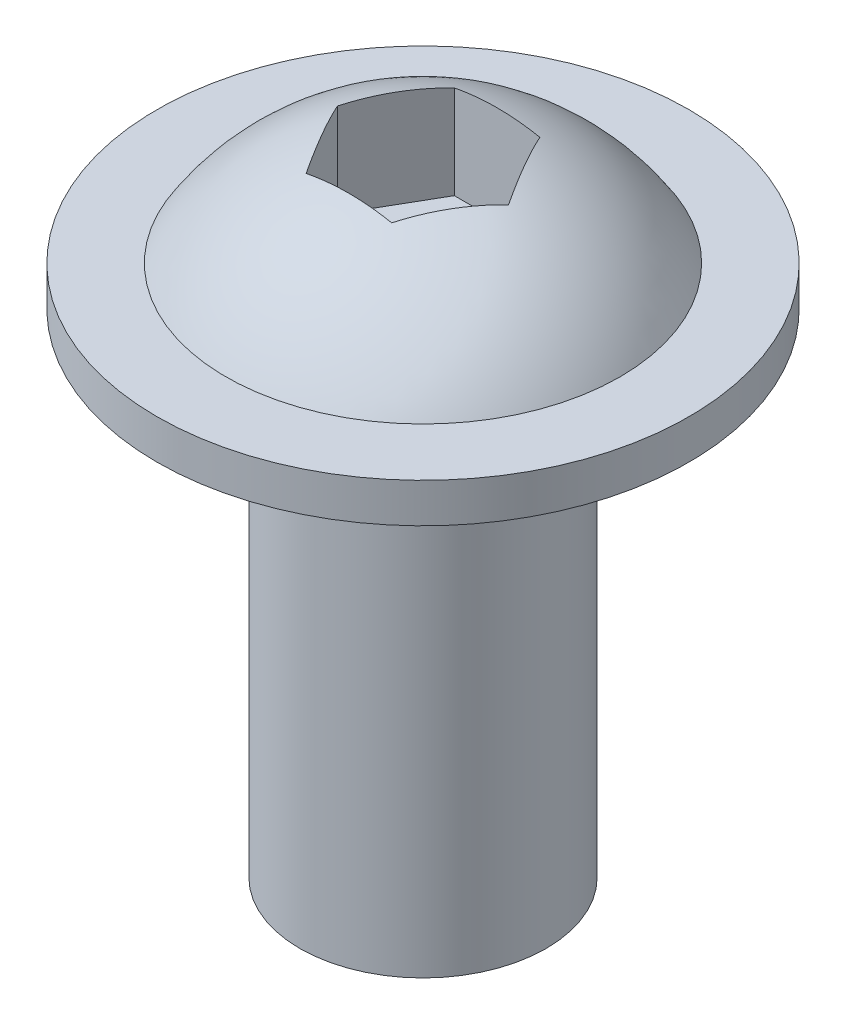
ISO-10303-21;
HEADER;
FILE_DESCRIPTION(('STEP AP214'),'2;1');
FILE_NAME('part.step','',(''),(''),'','','');
FILE_SCHEMA(('AUTOMOTIVE_DESIGN { 1 0 10303 214 1 1 1 1 }'));
ENDSEC;
DATA;
#1=APPLICATION_CONTEXT('core data for automotive mechanical design processes');
#2=APPLICATION_PROTOCOL_DEFINITION('international standard','automotive_design',2000,#1);
#3=PRODUCT_CONTEXT('',#1,'mechanical');
#4=PRODUCT('Part','Part','',(#3));
#5=PRODUCT_RELATED_PRODUCT_CATEGORY('part','',(#4));
#6=PRODUCT_DEFINITION_FORMATION('','',#4);
#7=PRODUCT_DEFINITION_CONTEXT('part definition',#1,'design');
#8=PRODUCT_DEFINITION('design','',#6,#7);
#9=PRODUCT_DEFINITION_SHAPE('','',#8);
#10=(LENGTH_UNIT() NAMED_UNIT(*) SI_UNIT(.MILLI.,.METRE.));
#11=(NAMED_UNIT(*) PLANE_ANGLE_UNIT() SI_UNIT($,.RADIAN.));
#12=(NAMED_UNIT(*) SI_UNIT($,.STERADIAN.) SOLID_ANGLE_UNIT());
#13=UNCERTAINTY_MEASURE_WITH_UNIT(LENGTH_MEASURE(1.E-05),#10,'distance_accuracy_value','');
#14=(GEOMETRIC_REPRESENTATION_CONTEXT(3) GLOBAL_UNCERTAINTY_ASSIGNED_CONTEXT((#13)) GLOBAL_UNIT_ASSIGNED_CONTEXT((#10,
#11,#12)) REPRESENTATION_CONTEXT('',''));
#15=CARTESIAN_POINT('',(0.,0.,0.));
#16=DIRECTION('',(0.,0.,1.));
#17=DIRECTION('',(1.,0.,0.));
#18=AXIS2_PLACEMENT_3D('',#15,#16,#17);
#19=CARTESIAN_POINT('',(0.,0.,0.));
#20=DIRECTION('',(0.,-1.,0.));
#21=DIRECTION('',(0.,0.,-1.));
#22=AXIS2_PLACEMENT_3D('',#19,#20,#21);
#23=PLANE('',#22);
#24=CARTESIAN_POINT('',(0.,0.,0.));
#25=DIRECTION('',(0.,-1.,0.));
#26=DIRECTION('',(0.,0.,-1.));
#27=AXIS2_PLACEMENT_3D('',#24,#25,#26);
#28=CIRCLE('',#27,3.96875);
#29=CARTESIAN_POINT('',(0.,0.,-3.96875));
#30=VERTEX_POINT('',#29);
#31=EDGE_CURVE('E133',#30,#30,#28,.T.);
#32=ORIENTED_EDGE('',*,*,#31,.T.);
#33=EDGE_LOOP('',(#32));
#34=FACE_BOUND('',#33,.T.);
#35=ADVANCED_FACE('F30',(#34),#23,.T.);
#36=CARTESIAN_POINT('',(0.,0.,0.));
#37=DIRECTION('',(0.,-1.,0.));
#38=DIRECTION('',(0.,0.,-1.));
#39=AXIS2_PLACEMENT_3D('',#36,#37,#38);
#40=CYLINDRICAL_SURFACE('',#39,3.96875);
#41=CARTESIAN_POINT('',(0.,15.875,0.));
#42=DIRECTION('',(0.,-1.,0.));
#43=DIRECTION('',(0.,0.,-1.));
#44=AXIS2_PLACEMENT_3D('',#41,#42,#43);
#45=CIRCLE('',#44,3.96875);
#46=CARTESIAN_POINT('',(0.,15.875,-3.96875));
#47=VERTEX_POINT('',#46);
#48=EDGE_CURVE('E130',#47,#47,#45,.T.);
#49=ORIENTED_EDGE('',*,*,#48,.T.);
#50=EDGE_LOOP('',(#49));
#51=FACE_BOUND('',#50,.T.);
#52=ORIENTED_EDGE('',*,*,#31,.F.);
#53=EDGE_LOOP('',(#52));
#54=FACE_BOUND('',#53,.T.);
#55=ADVANCED_FACE('F167',(#51,#54),#40,.T.);
#56=CARTESIAN_POINT('',(3.96875,15.875,0.));
#57=DIRECTION('',(0.,-1.,0.));
#58=DIRECTION('',(0.,0.,-1.));
#59=AXIS2_PLACEMENT_3D('',#56,#57,#58);
#60=PLANE('',#59);
#61=CARTESIAN_POINT('',(0.,15.875,0.));
#62=DIRECTION('',(0.,-1.,0.));
#63=DIRECTION('',(0.,0.,-1.));
#64=AXIS2_PLACEMENT_3D('',#61,#62,#63);
#65=CIRCLE('',#64,8.5725);
#66=CARTESIAN_POINT('',(0.,15.875,-8.5725));
#67=VERTEX_POINT('',#66);
#68=EDGE_CURVE('E127',#67,#67,#65,.T.);
#69=ORIENTED_EDGE('',*,*,#68,.T.);
#70=EDGE_LOOP('',(#69));
#71=FACE_BOUND('',#70,.T.);
#72=ORIENTED_EDGE('',*,*,#48,.F.);
#73=EDGE_LOOP('',(#72));
#74=FACE_BOUND('',#73,.T.);
#75=ADVANCED_FACE('F172',(#71,#74),#60,.T.);
#76=CARTESIAN_POINT('',(0.,0.,0.));
#77=DIRECTION('',(0.,-1.,0.));
#78=DIRECTION('',(0.,0.,-1.));
#79=AXIS2_PLACEMENT_3D('',#76,#77,#78);
#80=CYLINDRICAL_SURFACE('',#79,8.5725);
#81=CARTESIAN_POINT('',(0.,17.145,0.));
#82=DIRECTION('',(0.,-1.,0.));
#83=DIRECTION('',(0.,0.,-1.));
#84=AXIS2_PLACEMENT_3D('',#81,#82,#83);
#85=CIRCLE('',#84,8.5725);
#86=CARTESIAN_POINT('',(0.,17.145,-8.5725));
#87=VERTEX_POINT('',#86);
#88=EDGE_CURVE('E124',#87,#87,#85,.T.);
#89=ORIENTED_EDGE('',*,*,#88,.T.);
#90=EDGE_LOOP('',(#89));
#91=FACE_BOUND('',#90,.T.);
#92=ORIENTED_EDGE('',*,*,#68,.F.);
#93=EDGE_LOOP('',(#92));
#94=FACE_BOUND('',#93,.T.);
#95=ADVANCED_FACE('F179',(#91,#94),#80,.T.);
#96=CARTESIAN_POINT('',(8.5725,17.145,0.));
#97=DIRECTION('',(0.,1.,0.));
#98=DIRECTION('',(0.,0.,1.));
#99=AXIS2_PLACEMENT_3D('',#96,#97,#98);
#100=PLANE('',#99);
#101=CARTESIAN_POINT('',(0.,17.145,0.));
#102=DIRECTION('',(0.,-1.,0.));
#103=DIRECTION('',(0.,0.,-1.));
#104=AXIS2_PLACEMENT_3D('',#101,#102,#103);
#105=CIRCLE('',#104,6.35);
#106=CARTESIAN_POINT('',(0.,17.145,-6.35));
#107=VERTEX_POINT('',#106);
#108=EDGE_CURVE('E112',#107,#107,#105,.T.);
#109=ORIENTED_EDGE('',*,*,#108,.T.);
#110=EDGE_LOOP('',(#109));
#111=FACE_BOUND('',#110,.T.);
#112=ORIENTED_EDGE('',*,*,#88,.F.);
#113=EDGE_LOOP('',(#112));
#114=FACE_BOUND('',#113,.T.);
#115=ADVANCED_FACE('F185',(#111,#114),#100,.T.);
#116=CARTESIAN_POINT('',(0.,13.2093229166667,0.));
#117=DIRECTION('',(0.,-1.,0.));
#118=DIRECTION('',(1.,0.,0.));
#119=AXIS2_PLACEMENT_3D('',#116,#117,#118);
#120=SPHERICAL_SURFACE('',#119,7.47074655601937);
#121=CARTESIAN_POINT('',(2.06772225407573,13.2093229166667,1.1938));
#122=DIRECTION('',(0.866025403784439,0.,0.5));
#123=DIRECTION('',(0.5,0.,-0.866025403784439));
#124=AXIS2_PLACEMENT_3D('',#121,#122,#123);
#125=CIRCLE('',#124,7.0789420356629);
#126=CARTESIAN_POINT('',(1.37848150271715,20.1527521192251,2.3876));
#127=VERTEX_POINT('',#126);
#128=CARTESIAN_POINT('',(2.7569630054343,20.1527521192251,0.));
#129=VERTEX_POINT('',#128);
#130=EDGE_CURVE('E11',#127,#129,#125,.F.);
#131=ORIENTED_EDGE('',*,*,#130,.F.);
#132=CARTESIAN_POINT('',(0.,13.2093229166667,2.3876));
#133=DIRECTION('',(0.,0.,1.));
#134=DIRECTION('',(1.,0.,0.));
#135=AXIS2_PLACEMENT_3D('',#132,#133,#134);
#136=CIRCLE('',#135,7.0789420356629);
#137=CARTESIAN_POINT('',(-1.37848150271715,20.1527521192251,2.3876));
#138=VERTEX_POINT('',#137);
#139=EDGE_CURVE('E37',#138,#127,#136,.F.);
#140=ORIENTED_EDGE('',*,*,#139,.F.);
#141=CARTESIAN_POINT('',(-2.06772225407572,13.2093229166667,1.1938));
#142=DIRECTION('',(-0.866025403784439,0.,0.5));
#143=DIRECTION('',(0.5,0.,0.866025403784439));
#144=AXIS2_PLACEMENT_3D('',#141,#142,#143);
#145=CIRCLE('',#144,7.0789420356629);
#146=CARTESIAN_POINT('',(-2.7569630054343,20.1527521192251,0.));
#147=VERTEX_POINT('',#146);
#148=EDGE_CURVE('E142',#147,#138,#145,.F.);
#149=ORIENTED_EDGE('',*,*,#148,.F.);
#150=CARTESIAN_POINT('',(-2.06772225407573,13.2093229166667,-1.1938));
#151=DIRECTION('',(-0.866025403784439,0.,-0.5));
#152=DIRECTION('',(-0.5,0.,0.866025403784439));
#153=AXIS2_PLACEMENT_3D('',#150,#151,#152);
#154=CIRCLE('',#153,7.0789420356629);
#155=CARTESIAN_POINT('',(-1.37848150271715,20.1527521192251,-2.3876));
#156=VERTEX_POINT('',#155);
#157=EDGE_CURVE('E140',#156,#147,#154,.F.);
#158=ORIENTED_EDGE('',*,*,#157,.F.);
#159=CARTESIAN_POINT('',(0.,13.2093229166667,-2.3876));
#160=DIRECTION('',(0.,0.,-1.));
#161=DIRECTION('',(-1.,0.,0.));
#162=AXIS2_PLACEMENT_3D('',#159,#160,#161);
#163=CIRCLE('',#162,7.0789420356629);
#164=CARTESIAN_POINT('',(1.37848150271715,20.1527521192251,-2.3876));
#165=VERTEX_POINT('',#164);
#166=EDGE_CURVE('E138',#165,#156,#163,.F.);
#167=ORIENTED_EDGE('',*,*,#166,.F.);
#168=CARTESIAN_POINT('',(2.06772225407573,13.2093229166667,-1.1938));
#169=DIRECTION('',(0.866025403784439,0.,-0.5));
#170=DIRECTION('',(-0.5,0.,-0.866025403784439));
#171=AXIS2_PLACEMENT_3D('',#168,#169,#170);
#172=CIRCLE('',#171,7.0789420356629);
#173=EDGE_CURVE('E136',#129,#165,#172,.F.);
#174=ORIENTED_EDGE('',*,*,#173,.F.);
#175=EDGE_LOOP('',(#131,#140,#149,#158,#167,#174));
#176=FACE_BOUND('',#175,.T.);
#177=ORIENTED_EDGE('',*,*,#108,.F.);
#178=EDGE_LOOP('',(#177));
#179=FACE_BOUND('',#178,.T.);
#180=ADVANCED_FACE('F150',(#176,#179),#120,.T.);
#181=CARTESIAN_POINT('',(1.37848150271715,17.145,2.3876));
#182=DIRECTION('',(0.866025403784439,0.,0.5));
#183=DIRECTION('',(0.5,0.,-0.866025403784439));
#184=AXIS2_PLACEMENT_3D('',#181,#182,#183);
#185=PLANE('',#184);
#186=ORIENTED_EDGE('',*,*,#130,.T.);
#187=DIRECTION('',(0.,1.,0.));
#188=VECTOR('',#187,1.);
#189=CARTESIAN_POINT('',(2.7569630054343,17.145,0.));
#190=LINE('',#189,#188);
#191=CARTESIAN_POINT('',(2.7569630054343,17.145,0.));
#192=VERTEX_POINT('',#191);
#193=EDGE_CURVE('E44',#192,#129,#190,.T.);
#194=ORIENTED_EDGE('',*,*,#193,.F.);
#195=DIRECTION('',(0.5,0.,-0.866025403784439));
#196=VECTOR('',#195,1.);
#197=CARTESIAN_POINT('',(1.37848150271715,17.145,2.3876));
#198=LINE('',#197,#196);
#199=CARTESIAN_POINT('',(1.37848150271715,17.145,2.3876));
#200=VERTEX_POINT('',#199);
#201=EDGE_CURVE('E82',#200,#192,#198,.T.);
#202=ORIENTED_EDGE('',*,*,#201,.F.);
#203=DIRECTION('',(0.,1.,0.));
#204=VECTOR('',#203,1.);
#205=CARTESIAN_POINT('',(1.37848150271715,17.145,2.3876));
#206=LINE('',#205,#204);
#207=EDGE_CURVE('E110',#200,#127,#206,.T.);
#208=ORIENTED_EDGE('',*,*,#207,.T.);
#209=EDGE_LOOP('',(#186,#194,#202,#208));
#210=FACE_BOUND('',#209,.T.);
#211=ADVANCED_FACE('F80',(#210),#185,.F.);
#212=CARTESIAN_POINT('',(-1.37848150271715,17.145,2.3876));
#213=DIRECTION('',(0.,0.,1.));
#214=DIRECTION('',(1.,0.,0.));
#215=AXIS2_PLACEMENT_3D('',#212,#213,#214);
#216=PLANE('',#215);
#217=ORIENTED_EDGE('',*,*,#139,.T.);
#218=ORIENTED_EDGE('',*,*,#207,.F.);
#219=DIRECTION('',(1.,0.,0.));
#220=VECTOR('',#219,1.);
#221=CARTESIAN_POINT('',(-1.37848150271715,17.145,2.3876));
#222=LINE('',#221,#220);
#223=CARTESIAN_POINT('',(-1.37848150271715,17.145,2.3876));
#224=VERTEX_POINT('',#223);
#225=EDGE_CURVE('E87',#224,#200,#222,.T.);
#226=ORIENTED_EDGE('',*,*,#225,.F.);
#227=DIRECTION('',(0.,1.,0.));
#228=VECTOR('',#227,1.);
#229=CARTESIAN_POINT('',(-1.37848150271715,17.145,2.3876));
#230=LINE('',#229,#228);
#231=EDGE_CURVE('E113',#224,#138,#230,.T.);
#232=ORIENTED_EDGE('',*,*,#231,.T.);
#233=EDGE_LOOP('',(#217,#218,#226,#232));
#234=FACE_BOUND('',#233,.T.);
#235=ADVANCED_FACE('F149',(#234),#216,.F.);
#236=CARTESIAN_POINT('',(-2.7569630054343,17.145,0.));
#237=DIRECTION('',(-0.866025403784439,0.,0.5));
#238=DIRECTION('',(0.5,0.,0.866025403784439));
#239=AXIS2_PLACEMENT_3D('',#236,#237,#238);
#240=PLANE('',#239);
#241=ORIENTED_EDGE('',*,*,#148,.T.);
#242=ORIENTED_EDGE('',*,*,#231,.F.);
#243=DIRECTION('',(0.5,0.,0.866025403784439));
#244=VECTOR('',#243,1.);
#245=CARTESIAN_POINT('',(-2.7569630054343,17.145,0.));
#246=LINE('',#245,#244);
#247=CARTESIAN_POINT('',(-2.7569630054343,17.145,0.));
#248=VERTEX_POINT('',#247);
#249=EDGE_CURVE('E107',#248,#224,#246,.T.);
#250=ORIENTED_EDGE('',*,*,#249,.F.);
#251=DIRECTION('',(0.,1.,0.));
#252=VECTOR('',#251,1.);
#253=CARTESIAN_POINT('',(-2.7569630054343,17.145,0.));
#254=LINE('',#253,#252);
#255=EDGE_CURVE('E115',#248,#147,#254,.T.);
#256=ORIENTED_EDGE('',*,*,#255,.T.);
#257=EDGE_LOOP('',(#241,#242,#250,#256));
#258=FACE_BOUND('',#257,.T.);
#259=ADVANCED_FACE('F145',(#258),#240,.F.);
#260=CARTESIAN_POINT('',(-1.37848150271715,17.145,-2.3876));
#261=DIRECTION('',(-0.866025403784439,0.,-0.5));
#262=DIRECTION('',(-0.5,0.,0.866025403784439));
#263=AXIS2_PLACEMENT_3D('',#260,#261,#262);
#264=PLANE('',#263);
#265=ORIENTED_EDGE('',*,*,#157,.T.);
#266=ORIENTED_EDGE('',*,*,#255,.F.);
#267=DIRECTION('',(-0.5,0.,0.866025403784439));
#268=VECTOR('',#267,1.);
#269=CARTESIAN_POINT('',(-1.37848150271715,17.145,-2.3876));
#270=LINE('',#269,#268);
#271=CARTESIAN_POINT('',(-1.37848150271715,17.145,-2.3876));
#272=VERTEX_POINT('',#271);
#273=EDGE_CURVE('E104',#272,#248,#270,.T.);
#274=ORIENTED_EDGE('',*,*,#273,.F.);
#275=DIRECTION('',(0.,1.,0.));
#276=VECTOR('',#275,1.);
#277=CARTESIAN_POINT('',(-1.37848150271715,17.145,-2.3876));
#278=LINE('',#277,#276);
#279=EDGE_CURVE('E118',#272,#156,#278,.T.);
#280=ORIENTED_EDGE('',*,*,#279,.T.);
#281=EDGE_LOOP('',(#265,#266,#274,#280));
#282=FACE_BOUND('',#281,.T.);
#283=ADVANCED_FACE('F157',(#282),#264,.F.);
#284=CARTESIAN_POINT('',(1.37848150271715,17.145,-2.3876));
#285=DIRECTION('',(0.,0.,-1.));
#286=DIRECTION('',(-1.,0.,0.));
#287=AXIS2_PLACEMENT_3D('',#284,#285,#286);
#288=PLANE('',#287);
#289=ORIENTED_EDGE('',*,*,#166,.T.);
#290=ORIENTED_EDGE('',*,*,#279,.F.);
#291=DIRECTION('',(-1.,0.,0.));
#292=VECTOR('',#291,1.);
#293=CARTESIAN_POINT('',(1.37848150271715,17.145,-2.3876));
#294=LINE('',#293,#292);
#295=CARTESIAN_POINT('',(1.37848150271715,17.145,-2.3876));
#296=VERTEX_POINT('',#295);
#297=EDGE_CURVE('E96',#296,#272,#294,.T.);
#298=ORIENTED_EDGE('',*,*,#297,.F.);
#299=DIRECTION('',(0.,1.,0.));
#300=VECTOR('',#299,1.);
#301=CARTESIAN_POINT('',(1.37848150271715,17.145,-2.3876));
#302=LINE('',#301,#300);
#303=EDGE_CURVE('E86',#296,#165,#302,.T.);
#304=ORIENTED_EDGE('',*,*,#303,.T.);
#305=EDGE_LOOP('',(#289,#290,#298,#304));
#306=FACE_BOUND('',#305,.T.);
#307=ADVANCED_FACE('F154',(#306),#288,.F.);
#308=CARTESIAN_POINT('',(2.7569630054343,17.145,0.));
#309=DIRECTION('',(0.866025403784439,0.,-0.5));
#310=DIRECTION('',(-0.5,0.,-0.866025403784439));
#311=AXIS2_PLACEMENT_3D('',#308,#309,#310);
#312=PLANE('',#311);
#313=ORIENTED_EDGE('',*,*,#173,.T.);
#314=ORIENTED_EDGE('',*,*,#303,.F.);
#315=DIRECTION('',(-0.5,0.,-0.866025403784439));
#316=VECTOR('',#315,1.);
#317=CARTESIAN_POINT('',(2.7569630054343,17.145,0.));
#318=LINE('',#317,#316);
#319=EDGE_CURVE('E90',#192,#296,#318,.T.);
#320=ORIENTED_EDGE('',*,*,#319,.F.);
#321=ORIENTED_EDGE('',*,*,#193,.T.);
#322=EDGE_LOOP('',(#313,#314,#320,#321));
#323=FACE_BOUND('',#322,.T.);
#324=ADVANCED_FACE('F91',(#323),#312,.F.);
#325=CARTESIAN_POINT('',(2.7569630054343,17.145,0.));
#326=DIRECTION('',(0.,1.,0.));
#327=DIRECTION('',(0.,0.,1.));
#328=AXIS2_PLACEMENT_3D('',#325,#326,#327);
#329=PLANE('',#328);
#330=ORIENTED_EDGE('',*,*,#201,.T.);
#331=ORIENTED_EDGE('',*,*,#319,.T.);
#332=ORIENTED_EDGE('',*,*,#297,.T.);
#333=ORIENTED_EDGE('',*,*,#273,.T.);
#334=ORIENTED_EDGE('',*,*,#249,.T.);
#335=ORIENTED_EDGE('',*,*,#225,.T.);
#336=EDGE_LOOP('',(#330,#331,#332,#333,#334,#335));
#337=FACE_BOUND('',#336,.T.);
#338=ADVANCED_FACE('F98',(#337),#329,.T.);
#339=CLOSED_SHELL('',(#35,#55,#75,#95,#115,#180,#211,#235,#259,#283,#307,#324,#338));
#340=MANIFOLD_SOLID_BREP('B2',#339);
#341=ADVANCED_BREP_SHAPE_REPRESENTATION('',(#18,#340),#14);
#342=SHAPE_DEFINITION_REPRESENTATION(#9,#341);
ENDSEC;
END-ISO-10303-21;
